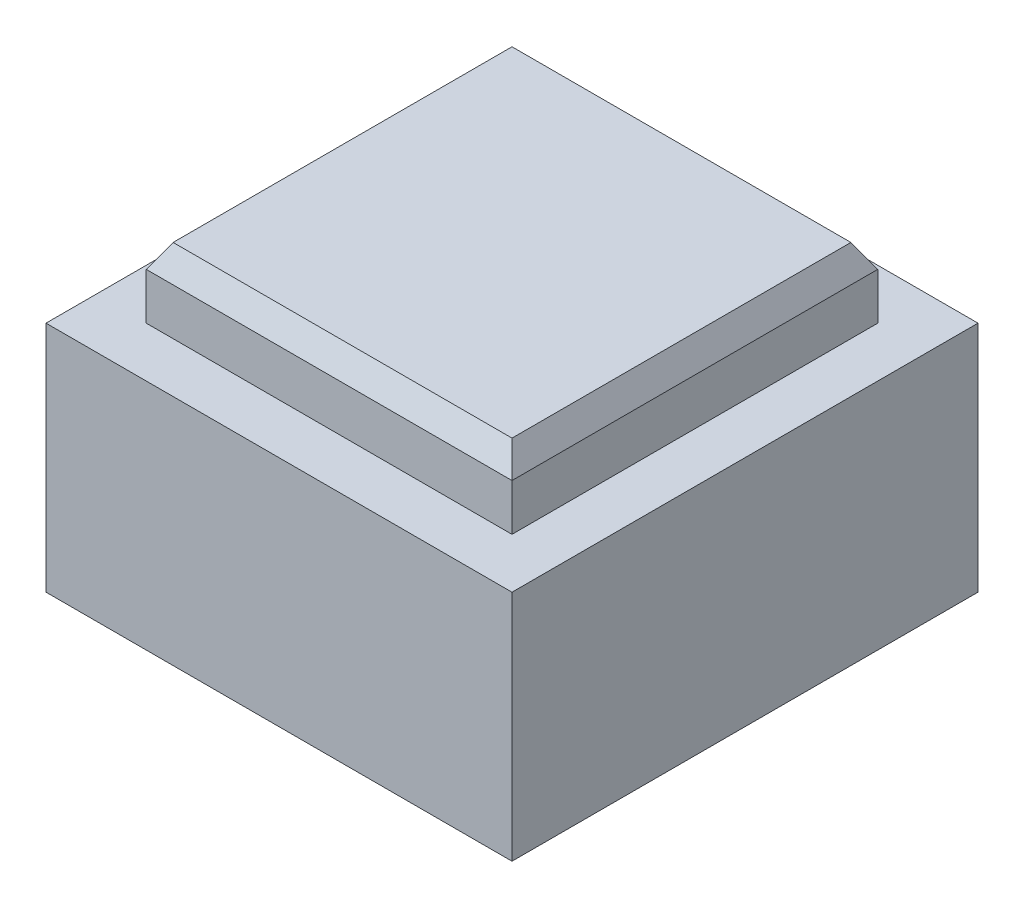
ISO-10303-21;
HEADER;
FILE_DESCRIPTION(('STEP AP214'),'2;1');
FILE_NAME('part.step','',(''),(''),'','','');
FILE_SCHEMA(('AUTOMOTIVE_DESIGN { 1 0 10303 214 1 1 1 1 }'));
ENDSEC;
DATA;
#1=APPLICATION_CONTEXT('core data for automotive mechanical design processes');
#2=APPLICATION_PROTOCOL_DEFINITION('international standard','automotive_design',2000,#1);
#3=PRODUCT_CONTEXT('',#1,'mechanical');
#4=PRODUCT('Part','Part','',(#3));
#5=PRODUCT_RELATED_PRODUCT_CATEGORY('part','',(#4));
#6=PRODUCT_DEFINITION_FORMATION('','',#4);
#7=PRODUCT_DEFINITION_CONTEXT('part definition',#1,'design');
#8=PRODUCT_DEFINITION('design','',#6,#7);
#9=PRODUCT_DEFINITION_SHAPE('','',#8);
#10=(LENGTH_UNIT() NAMED_UNIT(*) SI_UNIT(.MILLI.,.METRE.));
#11=(NAMED_UNIT(*) PLANE_ANGLE_UNIT() SI_UNIT($,.RADIAN.));
#12=(NAMED_UNIT(*) SI_UNIT($,.STERADIAN.) SOLID_ANGLE_UNIT());
#13=UNCERTAINTY_MEASURE_WITH_UNIT(LENGTH_MEASURE(1.E-05),#10,'distance_accuracy_value','');
#14=(GEOMETRIC_REPRESENTATION_CONTEXT(3) GLOBAL_UNCERTAINTY_ASSIGNED_CONTEXT((#13)) GLOBAL_UNIT_ASSIGNED_CONTEXT((#10,
#11,#12)) REPRESENTATION_CONTEXT('',''));
#15=CARTESIAN_POINT('',(0.,0.,0.));
#16=DIRECTION('',(0.,0.,1.));
#17=DIRECTION('',(1.,0.,0.));
#18=AXIS2_PLACEMENT_3D('',#15,#16,#17);
#19=CARTESIAN_POINT('',(0.,10.,0.));
#20=DIRECTION('',(0.,1.,0.));
#21=DIRECTION('',(0.,0.,1.));
#22=AXIS2_PLACEMENT_3D('',#19,#20,#21);
#23=PLANE('',#22);
#24=DIRECTION('',(0.,0.,1.));
#25=VECTOR('',#24,1.);
#26=CARTESIAN_POINT('',(-9.99999999999999,10.,10.));
#27=LINE('',#26,#25);
#28=CARTESIAN_POINT('',(-9.99999999999999,10.,-10.));
#29=VERTEX_POINT('',#28);
#30=CARTESIAN_POINT('',(-9.99999999999999,10.,10.));
#31=VERTEX_POINT('',#30);
#32=EDGE_CURVE('E233',#29,#31,#27,.T.);
#33=ORIENTED_EDGE('',*,*,#32,.T.);
#34=DIRECTION('',(1.,0.,0.));
#35=VECTOR('',#34,1.);
#36=CARTESIAN_POINT('',(10.,10.,10.));
#37=LINE('',#36,#35);
#38=CARTESIAN_POINT('',(10.,10.,10.));
#39=VERTEX_POINT('',#38);
#40=EDGE_CURVE('E236',#31,#39,#37,.T.);
#41=ORIENTED_EDGE('',*,*,#40,.T.);
#42=DIRECTION('',(0.,0.,-1.));
#43=VECTOR('',#42,1.);
#44=CARTESIAN_POINT('',(10.,10.,10.));
#45=LINE('',#44,#43);
#46=CARTESIAN_POINT('',(10.,10.,-10.));
#47=VERTEX_POINT('',#46);
#48=EDGE_CURVE('E239',#39,#47,#45,.T.);
#49=ORIENTED_EDGE('',*,*,#48,.T.);
#50=DIRECTION('',(-1.,0.,0.));
#51=VECTOR('',#50,1.);
#52=CARTESIAN_POINT('',(10.,10.,-10.));
#53=LINE('',#52,#51);
#54=EDGE_CURVE('E241',#47,#29,#53,.T.);
#55=ORIENTED_EDGE('',*,*,#54,.T.);
#56=EDGE_LOOP('',(#33,#41,#49,#55));
#57=FACE_BOUND('',#56,.T.);
#58=DIRECTION('',(1.,0.,0.));
#59=VECTOR('',#58,1.);
#60=CARTESIAN_POINT('',(7.85,10.,7.85));
#61=LINE('',#60,#59);
#62=CARTESIAN_POINT('',(-7.85,10.,7.85));
#63=VERTEX_POINT('',#62);
#64=CARTESIAN_POINT('',(7.85,10.,7.85));
#65=VERTEX_POINT('',#64);
#66=EDGE_CURVE('E214',#63,#65,#61,.T.);
#67=ORIENTED_EDGE('',*,*,#66,.F.);
#68=DIRECTION('',(0.,0.,1.));
#69=VECTOR('',#68,1.);
#70=CARTESIAN_POINT('',(-7.85,10.,7.85));
#71=LINE('',#70,#69);
#72=CARTESIAN_POINT('',(-7.85,10.,-7.85));
#73=VERTEX_POINT('',#72);
#74=EDGE_CURVE('E211',#73,#63,#71,.T.);
#75=ORIENTED_EDGE('',*,*,#74,.F.);
#76=DIRECTION('',(-1.,0.,0.));
#77=VECTOR('',#76,1.);
#78=CARTESIAN_POINT('',(7.85,10.,-7.85));
#79=LINE('',#78,#77);
#80=CARTESIAN_POINT('',(7.85,10.,-7.85));
#81=VERTEX_POINT('',#80);
#82=EDGE_CURVE('E221',#81,#73,#79,.T.);
#83=ORIENTED_EDGE('',*,*,#82,.F.);
#84=DIRECTION('',(0.,0.,-1.));
#85=VECTOR('',#84,1.);
#86=CARTESIAN_POINT('',(7.85,10.,7.85));
#87=LINE('',#86,#85);
#88=EDGE_CURVE('E218',#65,#81,#87,.T.);
#89=ORIENTED_EDGE('',*,*,#88,.F.);
#90=EDGE_LOOP('',(#67,#75,#83,#89));
#91=FACE_BOUND('',#90,.T.);
#92=ADVANCED_FACE('F35',(#57,#91),#23,.T.);
#93=CARTESIAN_POINT('',(-9.99999999999999,10.,10.));
#94=DIRECTION('',(1.,0.,0.));
#95=DIRECTION('',(0.,0.,-1.));
#96=AXIS2_PLACEMENT_3D('',#93,#94,#95);
#97=PLANE('',#96);
#98=DIRECTION('',(0.,0.,1.));
#99=VECTOR('',#98,1.);
#100=CARTESIAN_POINT('',(-9.99999999999999,0.,10.));
#101=LINE('',#100,#99);
#102=CARTESIAN_POINT('',(-9.99999999999999,0.,-10.));
#103=VERTEX_POINT('',#102);
#104=CARTESIAN_POINT('',(-9.99999999999999,0.,10.));
#105=VERTEX_POINT('',#104);
#106=EDGE_CURVE('E232',#103,#105,#101,.T.);
#107=ORIENTED_EDGE('',*,*,#106,.T.);
#108=DIRECTION('',(0.,-1.,0.));
#109=VECTOR('',#108,1.);
#110=CARTESIAN_POINT('',(-9.99999999999999,10.,10.));
#111=LINE('',#110,#109);
#112=EDGE_CURVE('E259',#31,#105,#111,.T.);
#113=ORIENTED_EDGE('',*,*,#112,.F.);
#114=ORIENTED_EDGE('',*,*,#32,.F.);
#115=DIRECTION('',(0.,-1.,0.));
#116=VECTOR('',#115,1.);
#117=CARTESIAN_POINT('',(-9.99999999999999,10.,-10.));
#118=LINE('',#117,#116);
#119=EDGE_CURVE('E243',#29,#103,#118,.T.);
#120=ORIENTED_EDGE('',*,*,#119,.T.);
#121=EDGE_LOOP('',(#107,#113,#114,#120));
#122=FACE_BOUND('',#121,.T.);
#123=ADVANCED_FACE('F359',(#122),#97,.F.);
#124=CARTESIAN_POINT('',(10.,10.,10.));
#125=DIRECTION('',(0.,0.,-1.));
#126=DIRECTION('',(-1.,0.,0.));
#127=AXIS2_PLACEMENT_3D('',#124,#125,#126);
#128=PLANE('',#127);
#129=DIRECTION('',(1.,0.,0.));
#130=VECTOR('',#129,1.);
#131=CARTESIAN_POINT('',(10.,0.,10.));
#132=LINE('',#131,#130);
#133=CARTESIAN_POINT('',(10.,0.,10.));
#134=VERTEX_POINT('',#133);
#135=EDGE_CURVE('E246',#105,#134,#132,.T.);
#136=ORIENTED_EDGE('',*,*,#135,.T.);
#137=DIRECTION('',(0.,-1.,0.));
#138=VECTOR('',#137,1.);
#139=CARTESIAN_POINT('',(10.,10.,10.));
#140=LINE('',#139,#138);
#141=EDGE_CURVE('E256',#39,#134,#140,.T.);
#142=ORIENTED_EDGE('',*,*,#141,.F.);
#143=ORIENTED_EDGE('',*,*,#40,.F.);
#144=ORIENTED_EDGE('',*,*,#112,.T.);
#145=EDGE_LOOP('',(#136,#142,#143,#144));
#146=FACE_BOUND('',#145,.T.);
#147=ADVANCED_FACE('F365',(#146),#128,.F.);
#148=CARTESIAN_POINT('',(10.,10.,10.));
#149=DIRECTION('',(-1.,0.,0.));
#150=DIRECTION('',(0.,0.,1.));
#151=AXIS2_PLACEMENT_3D('',#148,#149,#150);
#152=PLANE('',#151);
#153=DIRECTION('',(0.,0.,-1.));
#154=VECTOR('',#153,1.);
#155=CARTESIAN_POINT('',(10.,0.,10.));
#156=LINE('',#155,#154);
#157=CARTESIAN_POINT('',(10.,0.,-10.));
#158=VERTEX_POINT('',#157);
#159=EDGE_CURVE('E248',#134,#158,#156,.T.);
#160=ORIENTED_EDGE('',*,*,#159,.T.);
#161=DIRECTION('',(0.,-1.,0.));
#162=VECTOR('',#161,1.);
#163=CARTESIAN_POINT('',(10.,10.,-10.));
#164=LINE('',#163,#162);
#165=EDGE_CURVE('E253',#47,#158,#164,.T.);
#166=ORIENTED_EDGE('',*,*,#165,.F.);
#167=ORIENTED_EDGE('',*,*,#48,.F.);
#168=ORIENTED_EDGE('',*,*,#141,.T.);
#169=EDGE_LOOP('',(#160,#166,#167,#168));
#170=FACE_BOUND('',#169,.T.);
#171=ADVANCED_FACE('F380',(#170),#152,.F.);
#172=CARTESIAN_POINT('',(10.,10.,-10.));
#173=DIRECTION('',(0.,0.,1.));
#174=DIRECTION('',(1.,0.,0.));
#175=AXIS2_PLACEMENT_3D('',#172,#173,#174);
#176=PLANE('',#175);
#177=DIRECTION('',(-1.,0.,0.));
#178=VECTOR('',#177,1.);
#179=CARTESIAN_POINT('',(10.,0.,-10.));
#180=LINE('',#179,#178);
#181=EDGE_CURVE('E237',#158,#103,#180,.T.);
#182=ORIENTED_EDGE('',*,*,#181,.T.);
#183=ORIENTED_EDGE('',*,*,#119,.F.);
#184=ORIENTED_EDGE('',*,*,#54,.F.);
#185=ORIENTED_EDGE('',*,*,#165,.T.);
#186=EDGE_LOOP('',(#182,#183,#184,#185));
#187=FACE_BOUND('',#186,.T.);
#188=ADVANCED_FACE('F376',(#187),#176,.F.);
#189=CARTESIAN_POINT('',(0.,0.,0.));
#190=DIRECTION('',(0.,1.,0.));
#191=DIRECTION('',(0.,0.,1.));
#192=AXIS2_PLACEMENT_3D('',#189,#190,#191);
#193=PLANE('',#192);
#194=DIRECTION('',(-1.,0.,0.));
#195=VECTOR('',#194,1.);
#196=CARTESIAN_POINT('',(0.,0.,-7.40858798800485));
#197=LINE('',#196,#195);
#198=CARTESIAN_POINT('',(4.27735026918963,0.,-7.40858798800485));
#199=VERTEX_POINT('',#198);
#200=CARTESIAN_POINT('',(-4.27735026918962,0.,-7.40858798800485));
#201=VERTEX_POINT('',#200);
#202=EDGE_CURVE('E299',#199,#201,#197,.T.);
#203=ORIENTED_EDGE('',*,*,#202,.T.);
#204=DIRECTION('',(-0.5,0.,0.866025403784439));
#205=VECTOR('',#204,1.);
#206=CARTESIAN_POINT('',(-6.41602540378444,0.,-3.70429399400243));
#207=LINE('',#206,#205);
#208=CARTESIAN_POINT('',(-8.55470053837926,0.,0.));
#209=VERTEX_POINT('',#208);
#210=EDGE_CURVE('E301',#201,#209,#207,.T.);
#211=ORIENTED_EDGE('',*,*,#210,.T.);
#212=DIRECTION('',(0.5,0.,0.866025403784439));
#213=VECTOR('',#212,1.);
#214=CARTESIAN_POINT('',(-6.41602540378444,0.,3.70429399400243));
#215=LINE('',#214,#213);
#216=CARTESIAN_POINT('',(-4.27735026918963,0.,7.40858798800485));
#217=VERTEX_POINT('',#216);
#218=EDGE_CURVE('E291',#209,#217,#215,.T.);
#219=ORIENTED_EDGE('',*,*,#218,.T.);
#220=DIRECTION('',(1.,0.,0.));
#221=VECTOR('',#220,1.);
#222=CARTESIAN_POINT('',(0.,0.,7.40858798800485));
#223=LINE('',#222,#221);
#224=CARTESIAN_POINT('',(4.27735026918963,0.,7.40858798800485));
#225=VERTEX_POINT('',#224);
#226=EDGE_CURVE('E293',#217,#225,#223,.T.);
#227=ORIENTED_EDGE('',*,*,#226,.T.);
#228=DIRECTION('',(0.5,0.,-0.866025403784439));
#229=VECTOR('',#228,1.);
#230=CARTESIAN_POINT('',(6.41602540378444,0.,3.70429399400242));
#231=LINE('',#230,#229);
#232=CARTESIAN_POINT('',(8.55470053837925,0.,0.));
#233=VERTEX_POINT('',#232);
#234=EDGE_CURVE('E295',#225,#233,#231,.T.);
#235=ORIENTED_EDGE('',*,*,#234,.T.);
#236=DIRECTION('',(-0.5,0.,-0.866025403784439));
#237=VECTOR('',#236,1.);
#238=CARTESIAN_POINT('',(6.41602540378444,0.,-3.70429399400242));
#239=LINE('',#238,#237);
#240=EDGE_CURVE('E297',#233,#199,#239,.T.);
#241=ORIENTED_EDGE('',*,*,#240,.T.);
#242=EDGE_LOOP('',(#203,#211,#219,#227,#235,#241));
#243=FACE_BOUND('',#242,.T.);
#244=ORIENTED_EDGE('',*,*,#106,.F.);
#245=ORIENTED_EDGE('',*,*,#181,.F.);
#246=ORIENTED_EDGE('',*,*,#159,.F.);
#247=ORIENTED_EDGE('',*,*,#135,.F.);
#248=EDGE_LOOP('',(#244,#245,#246,#247));
#249=FACE_BOUND('',#248,.T.);
#250=ADVANCED_FACE('F373',(#243,#249),#193,.F.);
#251=CARTESIAN_POINT('',(-7.85,13.,7.85));
#252=DIRECTION('',(1.,0.,0.));
#253=DIRECTION('',(0.,0.,-1.));
#254=AXIS2_PLACEMENT_3D('',#251,#252,#253);
#255=PLANE('',#254);
#256=DIRECTION('',(0.,-1.,0.));
#257=VECTOR('',#256,1.);
#258=CARTESIAN_POINT('',(-7.85,13.,7.85));
#259=LINE('',#258,#257);
#260=CARTESIAN_POINT('',(-7.85,12.,7.85));
#261=VERTEX_POINT('',#260);
#262=EDGE_CURVE('E230',#261,#63,#259,.T.);
#263=ORIENTED_EDGE('',*,*,#262,.F.);
#264=DIRECTION('',(0.,0.,-1.));
#265=VECTOR('',#264,1.);
#266=CARTESIAN_POINT('',(-7.85,12.,-7.85));
#267=LINE('',#266,#265);
#268=CARTESIAN_POINT('',(-7.85,12.,-7.85));
#269=VERTEX_POINT('',#268);
#270=EDGE_CURVE('E278',#261,#269,#267,.T.);
#271=ORIENTED_EDGE('',*,*,#270,.T.);
#272=DIRECTION('',(0.,-1.,0.));
#273=VECTOR('',#272,1.);
#274=CARTESIAN_POINT('',(-7.85,13.,-7.85));
#275=LINE('',#274,#273);
#276=EDGE_CURVE('E224',#269,#73,#275,.T.);
#277=ORIENTED_EDGE('',*,*,#276,.T.);
#278=ORIENTED_EDGE('',*,*,#74,.T.);
#279=EDGE_LOOP('',(#263,#271,#277,#278));
#280=FACE_BOUND('',#279,.T.);
#281=ADVANCED_FACE('F371',(#280),#255,.F.);
#282=CARTESIAN_POINT('',(7.85,13.,7.85));
#283=DIRECTION('',(0.,0.,-1.));
#284=DIRECTION('',(-1.,0.,0.));
#285=AXIS2_PLACEMENT_3D('',#282,#283,#284);
#286=PLANE('',#285);
#287=DIRECTION('',(0.,-1.,0.));
#288=VECTOR('',#287,1.);
#289=CARTESIAN_POINT('',(7.85,13.,7.85));
#290=LINE('',#289,#288);
#291=CARTESIAN_POINT('',(7.85,12.,7.85));
#292=VERTEX_POINT('',#291);
#293=EDGE_CURVE('E228',#292,#65,#290,.T.);
#294=ORIENTED_EDGE('',*,*,#293,.F.);
#295=DIRECTION('',(-1.,0.,0.));
#296=VECTOR('',#295,1.);
#297=CARTESIAN_POINT('',(-7.85,12.,7.85));
#298=LINE('',#297,#296);
#299=EDGE_CURVE('E271',#292,#261,#298,.T.);
#300=ORIENTED_EDGE('',*,*,#299,.T.);
#301=ORIENTED_EDGE('',*,*,#262,.T.);
#302=ORIENTED_EDGE('',*,*,#66,.T.);
#303=EDGE_LOOP('',(#294,#300,#301,#302));
#304=FACE_BOUND('',#303,.T.);
#305=ADVANCED_FACE('F441',(#304),#286,.F.);
#306=CARTESIAN_POINT('',(7.85,13.,7.85));
#307=DIRECTION('',(-1.,0.,0.));
#308=DIRECTION('',(0.,0.,1.));
#309=AXIS2_PLACEMENT_3D('',#306,#307,#308);
#310=PLANE('',#309);
#311=DIRECTION('',(0.,-1.,0.));
#312=VECTOR('',#311,1.);
#313=CARTESIAN_POINT('',(7.85,13.,-7.85));
#314=LINE('',#313,#312);
#315=CARTESIAN_POINT('',(7.85,12.,-7.85));
#316=VERTEX_POINT('',#315);
#317=EDGE_CURVE('E226',#316,#81,#314,.T.);
#318=ORIENTED_EDGE('',*,*,#317,.F.);
#319=DIRECTION('',(0.,0.,1.));
#320=VECTOR('',#319,1.);
#321=CARTESIAN_POINT('',(7.85,12.,7.85));
#322=LINE('',#321,#320);
#323=EDGE_CURVE('E274',#316,#292,#322,.T.);
#324=ORIENTED_EDGE('',*,*,#323,.T.);
#325=ORIENTED_EDGE('',*,*,#293,.T.);
#326=ORIENTED_EDGE('',*,*,#88,.T.);
#327=EDGE_LOOP('',(#318,#324,#325,#326));
#328=FACE_BOUND('',#327,.T.);
#329=ADVANCED_FACE('F438',(#328),#310,.F.);
#330=CARTESIAN_POINT('',(7.85,13.,-7.85));
#331=DIRECTION('',(0.,0.,1.));
#332=DIRECTION('',(1.,0.,0.));
#333=AXIS2_PLACEMENT_3D('',#330,#331,#332);
#334=PLANE('',#333);
#335=ORIENTED_EDGE('',*,*,#276,.F.);
#336=DIRECTION('',(1.,0.,0.));
#337=VECTOR('',#336,1.);
#338=CARTESIAN_POINT('',(7.85,12.,-7.85));
#339=LINE('',#338,#337);
#340=EDGE_CURVE('E276',#269,#316,#339,.T.);
#341=ORIENTED_EDGE('',*,*,#340,.T.);
#342=ORIENTED_EDGE('',*,*,#317,.T.);
#343=ORIENTED_EDGE('',*,*,#82,.T.);
#344=EDGE_LOOP('',(#335,#341,#342,#343));
#345=FACE_BOUND('',#344,.T.);
#346=ADVANCED_FACE('F434',(#345),#334,.F.);
#347=CARTESIAN_POINT('',(0.,13.,0.));
#348=DIRECTION('',(0.,1.,0.));
#349=DIRECTION('',(0.,0.,1.));
#350=AXIS2_PLACEMENT_3D('',#347,#348,#349);
#351=PLANE('',#350);
#352=DIRECTION('',(0.,0.,1.));
#353=VECTOR('',#352,1.);
#354=CARTESIAN_POINT('',(-7.27264973081037,13.,7.85));
#355=LINE('',#354,#353);
#356=CARTESIAN_POINT('',(-7.27264973081037,13.,-7.27264973081037));
#357=VERTEX_POINT('',#356);
#358=CARTESIAN_POINT('',(-7.27264973081037,13.,7.27264973081038));
#359=VERTEX_POINT('',#358);
#360=EDGE_CURVE('E262',#357,#359,#355,.T.);
#361=ORIENTED_EDGE('',*,*,#360,.T.);
#362=DIRECTION('',(1.,0.,0.));
#363=VECTOR('',#362,1.);
#364=CARTESIAN_POINT('',(7.85,13.,7.27264973081037));
#365=LINE('',#364,#363);
#366=CARTESIAN_POINT('',(7.27264973081037,13.,7.27264973081037));
#367=VERTEX_POINT('',#366);
#368=EDGE_CURVE('E268',#359,#367,#365,.T.);
#369=ORIENTED_EDGE('',*,*,#368,.T.);
#370=DIRECTION('',(0.,0.,-1.));
#371=VECTOR('',#370,1.);
#372=CARTESIAN_POINT('',(7.27264973081037,13.,-7.85));
#373=LINE('',#372,#371);
#374=CARTESIAN_POINT('',(7.27264973081037,13.,-7.27264973081037));
#375=VERTEX_POINT('',#374);
#376=EDGE_CURVE('E266',#367,#375,#373,.T.);
#377=ORIENTED_EDGE('',*,*,#376,.T.);
#378=DIRECTION('',(-1.,0.,0.));
#379=VECTOR('',#378,1.);
#380=CARTESIAN_POINT('',(-7.85,13.,-7.27264973081037));
#381=LINE('',#380,#379);
#382=EDGE_CURVE('E264',#375,#357,#381,.T.);
#383=ORIENTED_EDGE('',*,*,#382,.T.);
#384=EDGE_LOOP('',(#361,#369,#377,#383));
#385=FACE_BOUND('',#384,.T.);
#386=ADVANCED_FACE('F402',(#385),#351,.T.);
#387=CARTESIAN_POINT('',(0.,13.,-7.27264973081037));
#388=DIRECTION('',(0.,0.499999999999996,-0.866025403784441));
#389=DIRECTION('',(1.,0.,0.));
#390=AXIS2_PLACEMENT_3D('',#387,#388,#389);
#391=PLANE('',#390);
#392=DIRECTION('',(0.447213595499955,-0.774596669241487,-0.447213595499955));
#393=VECTOR('',#392,1.);
#394=CARTESIAN_POINT('',(5.81811978464832,15.5193197678831,-5.81811978464832));
#395=LINE('',#394,#393);
#396=EDGE_CURVE('E284',#316,#375,#395,.F.);
#397=ORIENTED_EDGE('',*,*,#396,.F.);
#398=ORIENTED_EDGE('',*,*,#340,.F.);
#399=DIRECTION('',(-0.447213595499955,-0.774596669241487,-0.447213595499955));
#400=VECTOR('',#399,1.);
#401=CARTESIAN_POINT('',(-5.81811978464832,15.5193197678831,-5.81811978464831));
#402=LINE('',#401,#400);
#403=EDGE_CURVE('E215',#357,#269,#402,.T.);
#404=ORIENTED_EDGE('',*,*,#403,.F.);
#405=ORIENTED_EDGE('',*,*,#382,.F.);
#406=EDGE_LOOP('',(#397,#398,#404,#405));
#407=FACE_BOUND('',#406,.T.);
#408=ADVANCED_FACE('F398',(#407),#391,.T.);
#409=CARTESIAN_POINT('',(-7.27264973081037,13.,0.));
#410=DIRECTION('',(-0.866025403784441,0.499999999999996,0.));
#411=DIRECTION('',(0.,0.,-1.));
#412=AXIS2_PLACEMENT_3D('',#409,#410,#411);
#413=PLANE('',#412);
#414=ORIENTED_EDGE('',*,*,#403,.T.);
#415=ORIENTED_EDGE('',*,*,#270,.F.);
#416=DIRECTION('',(0.447213595499955,0.774596669241487,-0.447213595499955));
#417=VECTOR('',#416,1.);
#418=CARTESIAN_POINT('',(-5.81811978464832,15.5193197678831,5.81811978464832));
#419=LINE('',#418,#417);
#420=EDGE_CURVE('E282',#359,#261,#419,.F.);
#421=ORIENTED_EDGE('',*,*,#420,.F.);
#422=ORIENTED_EDGE('',*,*,#360,.F.);
#423=EDGE_LOOP('',(#414,#415,#421,#422));
#424=FACE_BOUND('',#423,.T.);
#425=ADVANCED_FACE('F394',(#424),#413,.T.);
#426=CARTESIAN_POINT('',(7.27264973081037,13.,0.));
#427=DIRECTION('',(0.866025403784441,0.499999999999996,0.));
#428=DIRECTION('',(0.,0.,1.));
#429=AXIS2_PLACEMENT_3D('',#426,#427,#428);
#430=PLANE('',#429);
#431=ORIENTED_EDGE('',*,*,#396,.T.);
#432=ORIENTED_EDGE('',*,*,#376,.F.);
#433=DIRECTION('',(0.447213595499955,-0.774596669241487,0.447213595499955));
#434=VECTOR('',#433,1.);
#435=CARTESIAN_POINT('',(5.81811978464832,15.5193197678831,5.81811978464832));
#436=LINE('',#435,#434);
#437=EDGE_CURVE('E201',#292,#367,#436,.F.);
#438=ORIENTED_EDGE('',*,*,#437,.F.);
#439=ORIENTED_EDGE('',*,*,#323,.F.);
#440=EDGE_LOOP('',(#431,#432,#438,#439));
#441=FACE_BOUND('',#440,.T.);
#442=ADVANCED_FACE('F390',(#441),#430,.T.);
#443=CARTESIAN_POINT('',(0.,13.,7.27264973081038));
#444=DIRECTION('',(0.,0.499999999999996,0.866025403784441));
#445=DIRECTION('',(-1.,0.,0.));
#446=AXIS2_PLACEMENT_3D('',#443,#444,#445);
#447=PLANE('',#446);
#448=ORIENTED_EDGE('',*,*,#420,.T.);
#449=ORIENTED_EDGE('',*,*,#299,.F.);
#450=ORIENTED_EDGE('',*,*,#437,.T.);
#451=ORIENTED_EDGE('',*,*,#368,.F.);
#452=EDGE_LOOP('',(#448,#449,#450,#451));
#453=FACE_BOUND('',#452,.T.);
#454=ADVANCED_FACE('F355',(#453),#447,.T.);
#455=CARTESIAN_POINT('',(3.7,8.,6.40858798800485));
#456=DIRECTION('',(0.,0.,1.));
#457=DIRECTION('',(1.,0.,0.));
#458=AXIS2_PLACEMENT_3D('',#455,#456,#457);
#459=PLANE('',#458);
#460=DIRECTION('',(0.,-1.,0.));
#461=VECTOR('',#460,1.);
#462=CARTESIAN_POINT('',(3.7,8.,6.40858798800485));
#463=LINE('',#462,#461);
#464=CARTESIAN_POINT('',(3.7,8.,6.40858798800485));
#465=VERTEX_POINT('',#464);
#466=CARTESIAN_POINT('',(3.7,2.74747741945463,6.40858798800485));
#467=VERTEX_POINT('',#466);
#468=EDGE_CURVE('E199',#465,#467,#463,.T.);
#469=ORIENTED_EDGE('',*,*,#468,.T.);
#470=DIRECTION('',(-1.,0.,0.));
#471=VECTOR('',#470,1.);
#472=CARTESIAN_POINT('',(3.7,2.74747741945463,6.40858798800485));
#473=LINE('',#472,#471);
#474=CARTESIAN_POINT('',(-3.7,2.74747741945462,6.40858798800485));
#475=VERTEX_POINT('',#474);
#476=EDGE_CURVE('E44',#467,#475,#473,.T.);
#477=ORIENTED_EDGE('',*,*,#476,.T.);
#478=DIRECTION('',(0.,-1.,0.));
#479=VECTOR('',#478,1.);
#480=CARTESIAN_POINT('',(-3.7,8.,6.40858798800485));
#481=LINE('',#480,#479);
#482=CARTESIAN_POINT('',(-3.7,8.,6.40858798800485));
#483=VERTEX_POINT('',#482);
#484=EDGE_CURVE('E165',#483,#475,#481,.T.);
#485=ORIENTED_EDGE('',*,*,#484,.F.);
#486=DIRECTION('',(-1.,0.,0.));
#487=VECTOR('',#486,1.);
#488=CARTESIAN_POINT('',(3.7,8.,6.40858798800485));
#489=LINE('',#488,#487);
#490=EDGE_CURVE('E169',#465,#483,#489,.T.);
#491=ORIENTED_EDGE('',*,*,#490,.F.);
#492=EDGE_LOOP('',(#469,#477,#485,#491));
#493=FACE_BOUND('',#492,.T.);
#494=ADVANCED_FACE('F167',(#493),#459,.F.);
#495=CARTESIAN_POINT('',(7.4,8.,0.));
#496=DIRECTION('',(0.866025403784439,0.,0.5));
#497=DIRECTION('',(0.5,0.,-0.866025403784439));
#498=AXIS2_PLACEMENT_3D('',#495,#496,#497);
#499=PLANE('',#498);
#500=DIRECTION('',(0.,-1.,0.));
#501=VECTOR('',#500,1.);
#502=CARTESIAN_POINT('',(7.4,8.,0.));
#503=LINE('',#502,#501);
#504=CARTESIAN_POINT('',(7.4,8.,0.));
#505=VERTEX_POINT('',#504);
#506=CARTESIAN_POINT('',(7.4,2.74747741945463,0.));
#507=VERTEX_POINT('',#506);
#508=EDGE_CURVE('E202',#505,#507,#503,.T.);
#509=ORIENTED_EDGE('',*,*,#508,.T.);
#510=DIRECTION('',(-0.5,0.,0.866025403784439));
#511=VECTOR('',#510,1.);
#512=CARTESIAN_POINT('',(7.4,2.74747741945463,0.));
#513=LINE('',#512,#511);
#514=EDGE_CURVE('E59',#507,#467,#513,.T.);
#515=ORIENTED_EDGE('',*,*,#514,.T.);
#516=ORIENTED_EDGE('',*,*,#468,.F.);
#517=DIRECTION('',(-0.5,0.,0.866025403784439));
#518=VECTOR('',#517,1.);
#519=CARTESIAN_POINT('',(7.4,8.,0.));
#520=LINE('',#519,#518);
#521=EDGE_CURVE('E174',#505,#465,#520,.T.);
#522=ORIENTED_EDGE('',*,*,#521,.F.);
#523=EDGE_LOOP('',(#509,#515,#516,#522));
#524=FACE_BOUND('',#523,.T.);
#525=ADVANCED_FACE('F347',(#524),#499,.F.);
#526=CARTESIAN_POINT('',(3.7,8.,-6.40858798800485));
#527=DIRECTION('',(0.866025403784439,0.,-0.5));
#528=DIRECTION('',(-0.5,0.,-0.866025403784439));
#529=AXIS2_PLACEMENT_3D('',#526,#527,#528);
#530=PLANE('',#529);
#531=DIRECTION('',(0.,-1.,0.));
#532=VECTOR('',#531,1.);
#533=CARTESIAN_POINT('',(3.7,8.,-6.40858798800485));
#534=LINE('',#533,#532);
#535=CARTESIAN_POINT('',(3.7,8.,-6.40858798800485));
#536=VERTEX_POINT('',#535);
#537=CARTESIAN_POINT('',(3.7,2.74747741945463,-6.40858798800485));
#538=VERTEX_POINT('',#537);
#539=EDGE_CURVE('E204',#536,#538,#534,.T.);
#540=ORIENTED_EDGE('',*,*,#539,.T.);
#541=DIRECTION('',(0.5,0.,0.866025403784439));
#542=VECTOR('',#541,1.);
#543=CARTESIAN_POINT('',(3.7,2.74747741945463,-6.40858798800485));
#544=LINE('',#543,#542);
#545=EDGE_CURVE('E306',#538,#507,#544,.T.);
#546=ORIENTED_EDGE('',*,*,#545,.T.);
#547=ORIENTED_EDGE('',*,*,#508,.F.);
#548=DIRECTION('',(0.5,0.,0.866025403784439));
#549=VECTOR('',#548,1.);
#550=CARTESIAN_POINT('',(3.7,8.,-6.40858798800485));
#551=LINE('',#550,#549);
#552=EDGE_CURVE('E196',#536,#505,#551,.T.);
#553=ORIENTED_EDGE('',*,*,#552,.F.);
#554=EDGE_LOOP('',(#540,#546,#547,#553));
#555=FACE_BOUND('',#554,.T.);
#556=ADVANCED_FACE('F346',(#555),#530,.F.);
#557=CARTESIAN_POINT('',(-3.7,8.,-6.40858798800485));
#558=DIRECTION('',(0.,0.,-1.));
#559=DIRECTION('',(-1.,0.,0.));
#560=AXIS2_PLACEMENT_3D('',#557,#558,#559);
#561=PLANE('',#560);
#562=DIRECTION('',(0.,-1.,0.));
#563=VECTOR('',#562,1.);
#564=CARTESIAN_POINT('',(-3.7,8.,-6.40858798800485));
#565=LINE('',#564,#563);
#566=CARTESIAN_POINT('',(-3.7,8.,-6.40858798800485));
#567=VERTEX_POINT('',#566);
#568=CARTESIAN_POINT('',(-3.7,2.74747741945463,-6.40858798800485));
#569=VERTEX_POINT('',#568);
#570=EDGE_CURVE('E207',#567,#569,#565,.T.);
#571=ORIENTED_EDGE('',*,*,#570,.T.);
#572=DIRECTION('',(1.,0.,0.));
#573=VECTOR('',#572,1.);
#574=CARTESIAN_POINT('',(-3.7,2.74747741945463,-6.40858798800485));
#575=LINE('',#574,#573);
#576=EDGE_CURVE('E304',#569,#538,#575,.T.);
#577=ORIENTED_EDGE('',*,*,#576,.T.);
#578=ORIENTED_EDGE('',*,*,#539,.F.);
#579=DIRECTION('',(1.,0.,0.));
#580=VECTOR('',#579,1.);
#581=CARTESIAN_POINT('',(-3.7,8.,-6.40858798800485));
#582=LINE('',#581,#580);
#583=EDGE_CURVE('E193',#567,#536,#582,.T.);
#584=ORIENTED_EDGE('',*,*,#583,.F.);
#585=EDGE_LOOP('',(#571,#577,#578,#584));
#586=FACE_BOUND('',#585,.T.);
#587=ADVANCED_FACE('F343',(#586),#561,.F.);
#588=CARTESIAN_POINT('',(-7.4,8.,0.));
#589=DIRECTION('',(-0.866025403784439,0.,-0.5));
#590=DIRECTION('',(-0.5,0.,0.866025403784439));
#591=AXIS2_PLACEMENT_3D('',#588,#589,#590);
#592=PLANE('',#591);
#593=DIRECTION('',(0.,-1.,0.));
#594=VECTOR('',#593,1.);
#595=CARTESIAN_POINT('',(-7.4,8.,0.));
#596=LINE('',#595,#594);
#597=CARTESIAN_POINT('',(-7.4,8.,0.));
#598=VERTEX_POINT('',#597);
#599=CARTESIAN_POINT('',(-7.4,2.74747741945462,0.));
#600=VERTEX_POINT('',#599);
#601=EDGE_CURVE('E173',#598,#600,#596,.T.);
#602=ORIENTED_EDGE('',*,*,#601,.T.);
#603=DIRECTION('',(0.5,0.,-0.866025403784439));
#604=VECTOR('',#603,1.);
#605=CARTESIAN_POINT('',(-7.4,2.74747741945463,0.));
#606=LINE('',#605,#604);
#607=EDGE_CURVE('E280',#600,#569,#606,.T.);
#608=ORIENTED_EDGE('',*,*,#607,.T.);
#609=ORIENTED_EDGE('',*,*,#570,.F.);
#610=DIRECTION('',(0.5,0.,-0.866025403784439));
#611=VECTOR('',#610,1.);
#612=CARTESIAN_POINT('',(-7.4,8.,0.));
#613=LINE('',#612,#611);
#614=EDGE_CURVE('E183',#598,#567,#613,.T.);
#615=ORIENTED_EDGE('',*,*,#614,.F.);
#616=EDGE_LOOP('',(#602,#608,#609,#615));
#617=FACE_BOUND('',#616,.T.);
#618=ADVANCED_FACE('F339',(#617),#592,.F.);
#619=CARTESIAN_POINT('',(-3.7,8.,6.40858798800485));
#620=DIRECTION('',(-0.866025403784439,0.,0.5));
#621=DIRECTION('',(0.5,0.,0.866025403784439));
#622=AXIS2_PLACEMENT_3D('',#619,#620,#621);
#623=PLANE('',#622);
#624=ORIENTED_EDGE('',*,*,#484,.T.);
#625=DIRECTION('',(-0.5,0.,-0.866025403784439));
#626=VECTOR('',#625,1.);
#627=CARTESIAN_POINT('',(-3.7,2.74747741945462,6.40858798800485));
#628=LINE('',#627,#626);
#629=EDGE_CURVE('E11',#475,#600,#628,.T.);
#630=ORIENTED_EDGE('',*,*,#629,.T.);
#631=ORIENTED_EDGE('',*,*,#601,.F.);
#632=DIRECTION('',(-0.5,0.,-0.866025403784439));
#633=VECTOR('',#632,1.);
#634=CARTESIAN_POINT('',(-3.7,8.,6.40858798800485));
#635=LINE('',#634,#633);
#636=EDGE_CURVE('E177',#483,#598,#635,.T.);
#637=ORIENTED_EDGE('',*,*,#636,.F.);
#638=EDGE_LOOP('',(#624,#630,#631,#637));
#639=FACE_BOUND('',#638,.T.);
#640=ADVANCED_FACE('F178',(#639),#623,.F.);
#641=CARTESIAN_POINT('',(0.,8.,0.));
#642=DIRECTION('',(0.,-1.,0.));
#643=DIRECTION('',(0.,0.,-1.));
#644=AXIS2_PLACEMENT_3D('',#641,#642,#643);
#645=PLANE('',#644);
#646=ORIENTED_EDGE('',*,*,#490,.T.);
#647=ORIENTED_EDGE('',*,*,#636,.T.);
#648=ORIENTED_EDGE('',*,*,#614,.T.);
#649=ORIENTED_EDGE('',*,*,#583,.T.);
#650=ORIENTED_EDGE('',*,*,#552,.T.);
#651=ORIENTED_EDGE('',*,*,#521,.T.);
#652=EDGE_LOOP('',(#646,#647,#648,#649,#650,#651));
#653=FACE_BOUND('',#652,.T.);
#654=ADVANCED_FACE('F185',(#653),#645,.T.);
#655=CARTESIAN_POINT('',(7.4,2.74747741945463,0.));
#656=DIRECTION('',(0.813797681349374,0.342020143325669,0.469846310392954));
#657=DIRECTION('',(-0.5,0.,0.866025403784439));
#658=AXIS2_PLACEMENT_3D('',#655,#656,#657);
#659=PLANE('',#658);
#660=DIRECTION('',(0.387449252410576,-0.921891033043757,0.));
#661=VECTOR('',#660,1.);
#662=CARTESIAN_POINT('',(6.844567384184,4.06906558821484,0.));
#663=LINE('',#662,#661);
#664=EDGE_CURVE('E190',#233,#507,#663,.F.);
#665=ORIENTED_EDGE('',*,*,#664,.F.);
#666=ORIENTED_EDGE('',*,*,#234,.F.);
#667=DIRECTION('',(0.193724626205288,-0.921891033043757,0.335540895264848));
#668=VECTOR('',#667,1.);
#669=CARTESIAN_POINT('',(3.422283692092,4.06906558821485,5.92756923261774));
#670=LINE('',#669,#668);
#671=EDGE_CURVE('E39',#467,#225,#670,.T.);
#672=ORIENTED_EDGE('',*,*,#671,.F.);
#673=ORIENTED_EDGE('',*,*,#514,.F.);
#674=EDGE_LOOP('',(#665,#666,#672,#673));
#675=FACE_BOUND('',#674,.T.);
#676=ADVANCED_FACE('F37',(#675),#659,.F.);
#677=CARTESIAN_POINT('',(3.7,2.74747741945463,6.40858798800485));
#678=DIRECTION('',(0.,0.342020143325669,0.939692620785908));
#679=DIRECTION('',(-1.,0.,0.));
#680=AXIS2_PLACEMENT_3D('',#677,#678,#679);
#681=PLANE('',#680);
#682=ORIENTED_EDGE('',*,*,#671,.T.);
#683=ORIENTED_EDGE('',*,*,#226,.F.);
#684=DIRECTION('',(-0.193724626205288,-0.921891033043757,0.335540895264848));
#685=VECTOR('',#684,1.);
#686=CARTESIAN_POINT('',(-3.422283692092,4.06906558821485,5.92756923261774));
#687=LINE('',#686,#685);
#688=EDGE_CURVE('E317',#475,#217,#687,.T.);
#689=ORIENTED_EDGE('',*,*,#688,.F.);
#690=ORIENTED_EDGE('',*,*,#476,.F.);
#691=EDGE_LOOP('',(#682,#683,#689,#690));
#692=FACE_BOUND('',#691,.T.);
#693=ADVANCED_FACE('F331',(#692),#681,.F.);
#694=CARTESIAN_POINT('',(3.7,2.74747741945463,-6.40858798800485));
#695=DIRECTION('',(0.813797681349374,0.34202014332567,-0.469846310392954));
#696=DIRECTION('',(0.5,0.,0.866025403784439));
#697=AXIS2_PLACEMENT_3D('',#694,#695,#696);
#698=PLANE('',#697);
#699=ORIENTED_EDGE('',*,*,#664,.T.);
#700=ORIENTED_EDGE('',*,*,#545,.F.);
#701=DIRECTION('',(0.193724626205289,-0.921891033043757,-0.335540895264848));
#702=VECTOR('',#701,1.);
#703=CARTESIAN_POINT('',(3.422283692092,4.06906558821485,-5.92756923261774));
#704=LINE('',#703,#702);
#705=EDGE_CURVE('E314',#199,#538,#704,.F.);
#706=ORIENTED_EDGE('',*,*,#705,.F.);
#707=ORIENTED_EDGE('',*,*,#240,.F.);
#708=EDGE_LOOP('',(#699,#700,#706,#707));
#709=FACE_BOUND('',#708,.T.);
#710=ADVANCED_FACE('F324',(#709),#698,.F.);
#711=CARTESIAN_POINT('',(-3.7,2.74747741945463,6.40858798800485));
#712=DIRECTION('',(-0.813797681349373,0.342020143325669,0.469846310392954));
#713=DIRECTION('',(-0.5,0.,-0.866025403784439));
#714=AXIS2_PLACEMENT_3D('',#711,#712,#713);
#715=PLANE('',#714);
#716=ORIENTED_EDGE('',*,*,#688,.T.);
#717=ORIENTED_EDGE('',*,*,#218,.F.);
#718=DIRECTION('',(0.387449252410576,0.921891033043757,0.));
#719=VECTOR('',#718,1.);
#720=CARTESIAN_POINT('',(-7.4,2.74747741945463,0.));
#721=LINE('',#720,#719);
#722=EDGE_CURVE('E312',#600,#209,#721,.F.);
#723=ORIENTED_EDGE('',*,*,#722,.F.);
#724=ORIENTED_EDGE('',*,*,#629,.F.);
#725=EDGE_LOOP('',(#716,#717,#723,#724));
#726=FACE_BOUND('',#725,.T.);
#727=ADVANCED_FACE('F336',(#726),#715,.F.);
#728=CARTESIAN_POINT('',(-3.7,2.74747741945463,-6.40858798800485));
#729=DIRECTION('',(0.,0.342020143325669,-0.939692620785908));
#730=DIRECTION('',(1.,0.,0.));
#731=AXIS2_PLACEMENT_3D('',#728,#729,#730);
#732=PLANE('',#731);
#733=ORIENTED_EDGE('',*,*,#705,.T.);
#734=ORIENTED_EDGE('',*,*,#576,.F.);
#735=DIRECTION('',(-0.193724626205288,-0.921891033043757,-0.335540895264848));
#736=VECTOR('',#735,1.);
#737=CARTESIAN_POINT('',(-3.422283692092,4.06906558821485,-5.92756923261775));
#738=LINE('',#737,#736);
#739=EDGE_CURVE('E310',#201,#569,#738,.F.);
#740=ORIENTED_EDGE('',*,*,#739,.F.);
#741=ORIENTED_EDGE('',*,*,#202,.F.);
#742=EDGE_LOOP('',(#733,#734,#740,#741));
#743=FACE_BOUND('',#742,.T.);
#744=ADVANCED_FACE('F407',(#743),#732,.F.);
#745=CARTESIAN_POINT('',(-7.4,2.74747741945463,0.));
#746=DIRECTION('',(-0.813797681349373,0.342020143325669,-0.469846310392954));
#747=DIRECTION('',(0.5,0.,-0.866025403784439));
#748=AXIS2_PLACEMENT_3D('',#745,#746,#747);
#749=PLANE('',#748);
#750=ORIENTED_EDGE('',*,*,#722,.T.);
#751=ORIENTED_EDGE('',*,*,#210,.F.);
#752=ORIENTED_EDGE('',*,*,#739,.T.);
#753=ORIENTED_EDGE('',*,*,#607,.F.);
#754=EDGE_LOOP('',(#750,#751,#752,#753));
#755=FACE_BOUND('',#754,.T.);
#756=ADVANCED_FACE('F404',(#755),#749,.F.);
#757=CLOSED_SHELL('',(#92,#123,#147,#171,#188,#250,#281,#305,#329,#346,#386,#408,#425,#442,#454,
#494,#525,#556,#587,#618,#640,#654,#676,#693,#710,#727,#744,#756));
#758=MANIFOLD_SOLID_BREP('B2',#757);
#759=ADVANCED_BREP_SHAPE_REPRESENTATION('',(#18,#758),#14);
#760=SHAPE_DEFINITION_REPRESENTATION(#9,#759);
ENDSEC;
END-ISO-10303-21;
